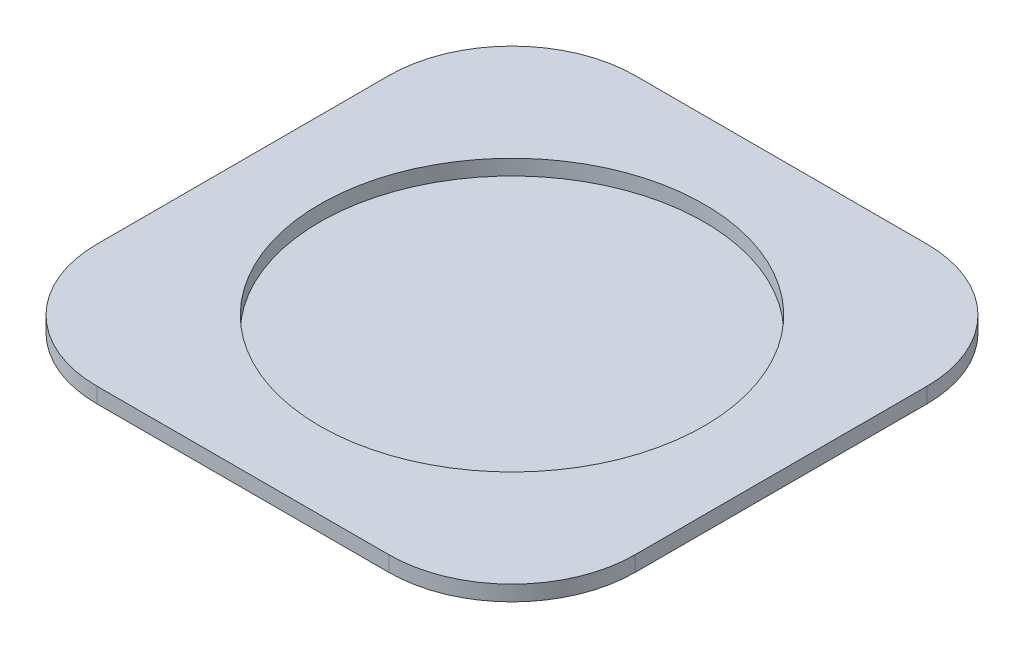
ISO-10303-21;
HEADER;
FILE_DESCRIPTION(('STEP AP214'),'2;1');
FILE_NAME('part.step','',(''),(''),'','','');
FILE_SCHEMA(('AUTOMOTIVE_DESIGN { 1 0 10303 214 1 1 1 1 }'));
ENDSEC;
DATA;
#1=APPLICATION_CONTEXT('core data for automotive mechanical design processes');
#2=APPLICATION_PROTOCOL_DEFINITION('international standard','automotive_design',2000,#1);
#3=PRODUCT_CONTEXT('',#1,'mechanical');
#4=PRODUCT('Part','Part','',(#3));
#5=PRODUCT_RELATED_PRODUCT_CATEGORY('part','',(#4));
#6=PRODUCT_DEFINITION_FORMATION('','',#4);
#7=PRODUCT_DEFINITION_CONTEXT('part definition',#1,'design');
#8=PRODUCT_DEFINITION('design','',#6,#7);
#9=PRODUCT_DEFINITION_SHAPE('','',#8);
#10=(LENGTH_UNIT() NAMED_UNIT(*) SI_UNIT(.MILLI.,.METRE.));
#11=(NAMED_UNIT(*) PLANE_ANGLE_UNIT() SI_UNIT($,.RADIAN.));
#12=(NAMED_UNIT(*) SI_UNIT($,.STERADIAN.) SOLID_ANGLE_UNIT());
#13=UNCERTAINTY_MEASURE_WITH_UNIT(LENGTH_MEASURE(1.E-05),#10,'distance_accuracy_value','');
#14=(GEOMETRIC_REPRESENTATION_CONTEXT(3) GLOBAL_UNCERTAINTY_ASSIGNED_CONTEXT((#13)) GLOBAL_UNIT_ASSIGNED_CONTEXT((#10,
#11,#12)) REPRESENTATION_CONTEXT('',''));
#15=CARTESIAN_POINT('',(0.,0.,0.));
#16=DIRECTION('',(0.,0.,1.));
#17=DIRECTION('',(1.,0.,0.));
#18=AXIS2_PLACEMENT_3D('',#15,#16,#17);
#19=CARTESIAN_POINT('',(0.,2.,0.));
#20=DIRECTION('',(0.,1.,0.));
#21=DIRECTION('',(0.,0.,1.));
#22=AXIS2_PLACEMENT_3D('',#19,#20,#21);
#23=PLANE('',#22);
#24=DIRECTION('',(0.,0.,-1.));
#25=VECTOR('',#24,1.);
#26=CARTESIAN_POINT('',(35.,2.,-35.));
#27=LINE('',#26,#25);
#28=CARTESIAN_POINT('',(35.,2.,19.));
#29=VERTEX_POINT('',#28);
#30=CARTESIAN_POINT('',(35.,2.,-19.));
#31=VERTEX_POINT('',#30);
#32=EDGE_CURVE('E180',#29,#31,#27,.T.);
#33=ORIENTED_EDGE('',*,*,#32,.T.);
#34=CARTESIAN_POINT('',(19.,2.,-19.));
#35=DIRECTION('',(0.,1.,0.));
#36=DIRECTION('',(0.,0.,1.));
#37=AXIS2_PLACEMENT_3D('',#34,#35,#36);
#38=CIRCLE('',#37,16.);
#39=CARTESIAN_POINT('',(19.,2.,-35.));
#40=VERTEX_POINT('',#39);
#41=EDGE_CURVE('E203',#31,#40,#38,.T.);
#42=ORIENTED_EDGE('',*,*,#41,.T.);
#43=DIRECTION('',(-1.,0.,0.));
#44=VECTOR('',#43,1.);
#45=CARTESIAN_POINT('',(-35.,2.,-35.));
#46=LINE('',#45,#44);
#47=CARTESIAN_POINT('',(-19.,2.,-35.));
#48=VERTEX_POINT('',#47);
#49=EDGE_CURVE('E156',#40,#48,#46,.T.);
#50=ORIENTED_EDGE('',*,*,#49,.T.);
#51=CARTESIAN_POINT('',(-19.,2.,-19.));
#52=DIRECTION('',(0.,1.,0.));
#53=DIRECTION('',(0.,0.,1.));
#54=AXIS2_PLACEMENT_3D('',#51,#52,#53);
#55=CIRCLE('',#54,16.);
#56=CARTESIAN_POINT('',(-35.,2.,-19.));
#57=VERTEX_POINT('',#56);
#58=EDGE_CURVE('E195',#48,#57,#55,.T.);
#59=ORIENTED_EDGE('',*,*,#58,.T.);
#60=DIRECTION('',(0.,0.,1.));
#61=VECTOR('',#60,1.);
#62=CARTESIAN_POINT('',(-35.,2.,-35.));
#63=LINE('',#62,#61);
#64=CARTESIAN_POINT('',(-35.,2.,19.));
#65=VERTEX_POINT('',#64);
#66=EDGE_CURVE('E220',#57,#65,#63,.T.);
#67=ORIENTED_EDGE('',*,*,#66,.T.);
#68=CARTESIAN_POINT('',(-19.,2.,19.));
#69=DIRECTION('',(0.,1.,0.));
#70=DIRECTION('',(0.,0.,1.));
#71=AXIS2_PLACEMENT_3D('',#68,#69,#70);
#72=CIRCLE('',#71,16.);
#73=CARTESIAN_POINT('',(-19.,2.,35.));
#74=VERTEX_POINT('',#73);
#75=EDGE_CURVE('E78',#65,#74,#72,.T.);
#76=ORIENTED_EDGE('',*,*,#75,.T.);
#77=DIRECTION('',(1.,0.,0.));
#78=VECTOR('',#77,1.);
#79=CARTESIAN_POINT('',(-35.,2.,35.));
#80=LINE('',#79,#78);
#81=CARTESIAN_POINT('',(19.,2.,35.));
#82=VERTEX_POINT('',#81);
#83=EDGE_CURVE('E182',#74,#82,#80,.T.);
#84=ORIENTED_EDGE('',*,*,#83,.T.);
#85=CARTESIAN_POINT('',(19.,2.,19.));
#86=DIRECTION('',(0.,1.,0.));
#87=DIRECTION('',(0.,0.,1.));
#88=AXIS2_PLACEMENT_3D('',#85,#86,#87);
#89=CIRCLE('',#88,16.);
#90=EDGE_CURVE('E198',#82,#29,#89,.T.);
#91=ORIENTED_EDGE('',*,*,#90,.T.);
#92=EDGE_LOOP('',(#33,#42,#50,#59,#67,#76,#84,#91));
#93=FACE_BOUND('',#92,.T.);
#94=CARTESIAN_POINT('',(0.,2.,0.));
#95=DIRECTION('',(0.,1.,0.));
#96=DIRECTION('',(0.,0.,1.));
#97=AXIS2_PLACEMENT_3D('',#94,#95,#96);
#98=CIRCLE('',#97,25.);
#99=CARTESIAN_POINT('',(0.,2.,25.));
#100=VERTEX_POINT('',#99);
#101=EDGE_CURVE('E174',#100,#100,#98,.T.);
#102=ORIENTED_EDGE('',*,*,#101,.F.);
#103=EDGE_LOOP('',(#102));
#104=FACE_BOUND('',#103,.T.);
#105=ADVANCED_FACE('F51',(#93,#104),#23,.T.);
#106=CARTESIAN_POINT('',(0.,0.,0.));
#107=DIRECTION('',(0.,1.,0.));
#108=DIRECTION('',(0.,0.,1.));
#109=AXIS2_PLACEMENT_3D('',#106,#107,#108);
#110=PLANE('',#109);
#111=CARTESIAN_POINT('',(0.,0.,0.));
#112=DIRECTION('',(0.,1.,0.));
#113=DIRECTION('',(0.,0.,1.));
#114=AXIS2_PLACEMENT_3D('',#111,#112,#113);
#115=CIRCLE('',#114,32.5);
#116=CARTESIAN_POINT('',(0.,0.,32.5));
#117=VERTEX_POINT('',#116);
#118=EDGE_CURVE('E13',#117,#117,#115,.F.);
#119=ORIENTED_EDGE('',*,*,#118,.F.);
#120=EDGE_LOOP('',(#119));
#121=FACE_BOUND('',#120,.T.);
#122=DIRECTION('',(-1.,0.,0.));
#123=VECTOR('',#122,1.);
#124=CARTESIAN_POINT('',(-35.,0.,-35.));
#125=LINE('',#124,#123);
#126=CARTESIAN_POINT('',(19.,0.,-35.));
#127=VERTEX_POINT('',#126);
#128=CARTESIAN_POINT('',(-19.,0.,-35.));
#129=VERTEX_POINT('',#128);
#130=EDGE_CURVE('E153',#127,#129,#125,.T.);
#131=ORIENTED_EDGE('',*,*,#130,.F.);
#132=CARTESIAN_POINT('',(19.,0.,-19.));
#133=DIRECTION('',(0.,1.,0.));
#134=DIRECTION('',(0.,0.,1.));
#135=AXIS2_PLACEMENT_3D('',#132,#133,#134);
#136=CIRCLE('',#135,16.);
#137=CARTESIAN_POINT('',(35.,0.,-19.));
#138=VERTEX_POINT('',#137);
#139=EDGE_CURVE('E135',#127,#138,#136,.F.);
#140=ORIENTED_EDGE('',*,*,#139,.T.);
#141=DIRECTION('',(0.,0.,-1.));
#142=VECTOR('',#141,1.);
#143=CARTESIAN_POINT('',(35.,0.,-35.));
#144=LINE('',#143,#142);
#145=CARTESIAN_POINT('',(35.,0.,19.));
#146=VERTEX_POINT('',#145);
#147=EDGE_CURVE('E165',#146,#138,#144,.T.);
#148=ORIENTED_EDGE('',*,*,#147,.F.);
#149=CARTESIAN_POINT('',(19.,0.,19.));
#150=DIRECTION('',(0.,1.,0.));
#151=DIRECTION('',(0.,0.,1.));
#152=AXIS2_PLACEMENT_3D('',#149,#150,#151);
#153=CIRCLE('',#152,16.);
#154=CARTESIAN_POINT('',(19.,0.,35.));
#155=VERTEX_POINT('',#154);
#156=EDGE_CURVE('E186',#146,#155,#153,.F.);
#157=ORIENTED_EDGE('',*,*,#156,.T.);
#158=DIRECTION('',(1.,0.,0.));
#159=VECTOR('',#158,1.);
#160=CARTESIAN_POINT('',(-35.,0.,35.));
#161=LINE('',#160,#159);
#162=CARTESIAN_POINT('',(-19.,0.,35.));
#163=VERTEX_POINT('',#162);
#164=EDGE_CURVE('E171',#163,#155,#161,.T.);
#165=ORIENTED_EDGE('',*,*,#164,.F.);
#166=CARTESIAN_POINT('',(-19.,0.,19.));
#167=DIRECTION('',(0.,1.,0.));
#168=DIRECTION('',(0.,0.,1.));
#169=AXIS2_PLACEMENT_3D('',#166,#167,#168);
#170=CIRCLE('',#169,16.);
#171=CARTESIAN_POINT('',(-35.,0.,19.));
#172=VERTEX_POINT('',#171);
#173=EDGE_CURVE('E147',#163,#172,#170,.F.);
#174=ORIENTED_EDGE('',*,*,#173,.T.);
#175=DIRECTION('',(0.,0.,1.));
#176=VECTOR('',#175,1.);
#177=CARTESIAN_POINT('',(-35.,0.,-35.));
#178=LINE('',#177,#176);
#179=CARTESIAN_POINT('',(-35.,0.,-19.));
#180=VERTEX_POINT('',#179);
#181=EDGE_CURVE('E164',#180,#172,#178,.T.);
#182=ORIENTED_EDGE('',*,*,#181,.F.);
#183=CARTESIAN_POINT('',(-19.,0.,-19.));
#184=DIRECTION('',(0.,1.,0.));
#185=DIRECTION('',(0.,0.,1.));
#186=AXIS2_PLACEMENT_3D('',#183,#184,#185);
#187=CIRCLE('',#186,16.);
#188=EDGE_CURVE('E158',#180,#129,#187,.F.);
#189=ORIENTED_EDGE('',*,*,#188,.T.);
#190=EDGE_LOOP('',(#131,#140,#148,#157,#165,#174,#182,#189));
#191=FACE_BOUND('',#190,.T.);
#192=ADVANCED_FACE('F161',(#121,#191),#110,.F.);
#193=CARTESIAN_POINT('',(35.,2.,-35.));
#194=DIRECTION('',(-1.,0.,0.));
#195=DIRECTION('',(0.,0.,1.));
#196=AXIS2_PLACEMENT_3D('',#193,#194,#195);
#197=PLANE('',#196);
#198=ORIENTED_EDGE('',*,*,#147,.T.);
#199=DIRECTION('',(0.,-1.,0.));
#200=VECTOR('',#199,1.);
#201=CARTESIAN_POINT('',(35.,2.,-19.));
#202=LINE('',#201,#200);
#203=EDGE_CURVE('E140',#138,#31,#202,.F.);
#204=ORIENTED_EDGE('',*,*,#203,.T.);
#205=ORIENTED_EDGE('',*,*,#32,.F.);
#206=DIRECTION('',(0.,-1.,0.));
#207=VECTOR('',#206,1.);
#208=CARTESIAN_POINT('',(35.,2.,19.));
#209=LINE('',#208,#207);
#210=EDGE_CURVE('E146',#29,#146,#209,.T.);
#211=ORIENTED_EDGE('',*,*,#210,.T.);
#212=EDGE_LOOP('',(#198,#204,#205,#211));
#213=FACE_BOUND('',#212,.T.);
#214=ADVANCED_FACE('F238',(#213),#197,.F.);
#215=CARTESIAN_POINT('',(-35.,2.,-35.));
#216=DIRECTION('',(0.,0.,1.));
#217=DIRECTION('',(1.,0.,0.));
#218=AXIS2_PLACEMENT_3D('',#215,#216,#217);
#219=PLANE('',#218);
#220=ORIENTED_EDGE('',*,*,#49,.F.);
#221=DIRECTION('',(0.,-1.,0.));
#222=VECTOR('',#221,1.);
#223=CARTESIAN_POINT('',(19.,2.,-35.));
#224=LINE('',#223,#222);
#225=EDGE_CURVE('E139',#40,#127,#224,.T.);
#226=ORIENTED_EDGE('',*,*,#225,.T.);
#227=ORIENTED_EDGE('',*,*,#130,.T.);
#228=DIRECTION('',(0.,-1.,0.));
#229=VECTOR('',#228,1.);
#230=CARTESIAN_POINT('',(-19.,2.,-35.));
#231=LINE('',#230,#229);
#232=EDGE_CURVE('E159',#129,#48,#231,.F.);
#233=ORIENTED_EDGE('',*,*,#232,.T.);
#234=EDGE_LOOP('',(#220,#226,#227,#233));
#235=FACE_BOUND('',#234,.T.);
#236=ADVANCED_FACE('F152',(#235),#219,.F.);
#237=CARTESIAN_POINT('',(-35.,2.,-35.));
#238=DIRECTION('',(1.,0.,0.));
#239=DIRECTION('',(0.,0.,-1.));
#240=AXIS2_PLACEMENT_3D('',#237,#238,#239);
#241=PLANE('',#240);
#242=ORIENTED_EDGE('',*,*,#181,.T.);
#243=DIRECTION('',(0.,-1.,0.));
#244=VECTOR('',#243,1.);
#245=CARTESIAN_POINT('',(-35.,2.,19.));
#246=LINE('',#245,#244);
#247=EDGE_CURVE('E60',#172,#65,#246,.F.);
#248=ORIENTED_EDGE('',*,*,#247,.T.);
#249=ORIENTED_EDGE('',*,*,#66,.F.);
#250=DIRECTION('',(0.,-1.,0.));
#251=VECTOR('',#250,1.);
#252=CARTESIAN_POINT('',(-35.,2.,-19.));
#253=LINE('',#252,#251);
#254=EDGE_CURVE('E212',#57,#180,#253,.T.);
#255=ORIENTED_EDGE('',*,*,#254,.T.);
#256=EDGE_LOOP('',(#242,#248,#249,#255));
#257=FACE_BOUND('',#256,.T.);
#258=ADVANCED_FACE('F219',(#257),#241,.F.);
#259=CARTESIAN_POINT('',(-35.,2.,35.));
#260=DIRECTION('',(0.,0.,-1.));
#261=DIRECTION('',(-1.,0.,0.));
#262=AXIS2_PLACEMENT_3D('',#259,#260,#261);
#263=PLANE('',#262);
#264=ORIENTED_EDGE('',*,*,#83,.F.);
#265=DIRECTION('',(0.,-1.,0.));
#266=VECTOR('',#265,1.);
#267=CARTESIAN_POINT('',(-19.,2.,35.));
#268=LINE('',#267,#266);
#269=EDGE_CURVE('E208',#74,#163,#268,.T.);
#270=ORIENTED_EDGE('',*,*,#269,.T.);
#271=ORIENTED_EDGE('',*,*,#164,.T.);
#272=DIRECTION('',(0.,-1.,0.));
#273=VECTOR('',#272,1.);
#274=CARTESIAN_POINT('',(19.,2.,35.));
#275=LINE('',#274,#273);
#276=EDGE_CURVE('E70',#155,#82,#275,.F.);
#277=ORIENTED_EDGE('',*,*,#276,.T.);
#278=EDGE_LOOP('',(#264,#270,#271,#277));
#279=FACE_BOUND('',#278,.T.);
#280=ADVANCED_FACE('F231',(#279),#263,.F.);
#281=CARTESIAN_POINT('',(0.,2.,0.));
#282=DIRECTION('',(0.,-1.,0.));
#283=DIRECTION('',(0.,0.,-1.));
#284=AXIS2_PLACEMENT_3D('',#281,#282,#283);
#285=CYLINDRICAL_SURFACE('',#284,25.);
#286=ORIENTED_EDGE('',*,*,#101,.T.);
#287=EDGE_LOOP('',(#286));
#288=FACE_BOUND('',#287,.T.);
#289=CARTESIAN_POINT('',(0.,0.,0.));
#290=DIRECTION('',(0.,1.,0.));
#291=DIRECTION('',(0.,0.,1.));
#292=AXIS2_PLACEMENT_3D('',#289,#290,#291);
#293=CIRCLE('',#292,25.);
#294=CARTESIAN_POINT('',(0.,0.,25.));
#295=VERTEX_POINT('',#294);
#296=EDGE_CURVE('E243',#295,#295,#293,.T.);
#297=ORIENTED_EDGE('',*,*,#296,.F.);
#298=EDGE_LOOP('',(#297));
#299=FACE_BOUND('',#298,.T.);
#300=ADVANCED_FACE('F256',(#288,#299),#285,.F.);
#301=CARTESIAN_POINT('',(19.,2.,-19.));
#302=DIRECTION('',(0.,-1.,0.));
#303=DIRECTION('',(0.,0.,-1.));
#304=AXIS2_PLACEMENT_3D('',#301,#302,#303);
#305=CYLINDRICAL_SURFACE('',#304,16.);
#306=ORIENTED_EDGE('',*,*,#41,.F.);
#307=ORIENTED_EDGE('',*,*,#203,.F.);
#308=ORIENTED_EDGE('',*,*,#139,.F.);
#309=ORIENTED_EDGE('',*,*,#225,.F.);
#310=EDGE_LOOP('',(#306,#307,#308,#309));
#311=FACE_BOUND('',#310,.T.);
#312=ADVANCED_FACE('F138',(#311),#305,.T.);
#313=CARTESIAN_POINT('',(-19.,2.,19.));
#314=DIRECTION('',(0.,-1.,0.));
#315=DIRECTION('',(0.,0.,-1.));
#316=AXIS2_PLACEMENT_3D('',#313,#314,#315);
#317=CYLINDRICAL_SURFACE('',#316,16.);
#318=ORIENTED_EDGE('',*,*,#75,.F.);
#319=ORIENTED_EDGE('',*,*,#247,.F.);
#320=ORIENTED_EDGE('',*,*,#173,.F.);
#321=ORIENTED_EDGE('',*,*,#269,.F.);
#322=EDGE_LOOP('',(#318,#319,#320,#321));
#323=FACE_BOUND('',#322,.T.);
#324=ADVANCED_FACE('F229',(#323),#317,.T.);
#325=CARTESIAN_POINT('',(19.,2.,19.));
#326=DIRECTION('',(0.,-1.,0.));
#327=DIRECTION('',(0.,0.,-1.));
#328=AXIS2_PLACEMENT_3D('',#325,#326,#327);
#329=CYLINDRICAL_SURFACE('',#328,16.);
#330=ORIENTED_EDGE('',*,*,#90,.F.);
#331=ORIENTED_EDGE('',*,*,#276,.F.);
#332=ORIENTED_EDGE('',*,*,#156,.F.);
#333=ORIENTED_EDGE('',*,*,#210,.F.);
#334=EDGE_LOOP('',(#330,#331,#332,#333));
#335=FACE_BOUND('',#334,.T.);
#336=ADVANCED_FACE('F235',(#335),#329,.T.);
#337=CARTESIAN_POINT('',(-19.,2.,-19.));
#338=DIRECTION('',(0.,-1.,0.));
#339=DIRECTION('',(0.,0.,-1.));
#340=AXIS2_PLACEMENT_3D('',#337,#338,#339);
#341=CYLINDRICAL_SURFACE('',#340,16.);
#342=ORIENTED_EDGE('',*,*,#58,.F.);
#343=ORIENTED_EDGE('',*,*,#232,.F.);
#344=ORIENTED_EDGE('',*,*,#188,.F.);
#345=ORIENTED_EDGE('',*,*,#254,.F.);
#346=EDGE_LOOP('',(#342,#343,#344,#345));
#347=FACE_BOUND('',#346,.T.);
#348=ADVANCED_FACE('F53',(#347),#341,.T.);
#349=CARTESIAN_POINT('',(0.,0.,0.));
#350=DIRECTION('',(0.,-1.,0.));
#351=DIRECTION('',(0.,0.,-1.));
#352=AXIS2_PLACEMENT_3D('',#349,#350,#351);
#353=PLANE('',#352);
#354=ORIENTED_EDGE('',*,*,#296,.T.);
#355=EDGE_LOOP('',(#354));
#356=FACE_BOUND('',#355,.T.);
#357=ADVANCED_FACE('F283',(#356),#353,.F.);
#358=CARTESIAN_POINT('',(0.,-2.,0.));
#359=DIRECTION('',(0.,1.,0.));
#360=DIRECTION('',(0.,0.,1.));
#361=AXIS2_PLACEMENT_3D('',#358,#359,#360);
#362=CYLINDRICAL_SURFACE('',#361,32.5);
#363=CARTESIAN_POINT('',(0.,-2.,0.));
#364=DIRECTION('',(0.,-1.,0.));
#365=DIRECTION('',(0.,0.,-1.));
#366=AXIS2_PLACEMENT_3D('',#363,#364,#365);
#367=CIRCLE('',#366,32.5);
#368=CARTESIAN_POINT('',(0.,-2.,-32.5));
#369=VERTEX_POINT('',#368);
#370=EDGE_CURVE('E247',#369,#369,#367,.T.);
#371=ORIENTED_EDGE('',*,*,#370,.F.);
#372=EDGE_LOOP('',(#371));
#373=FACE_BOUND('',#372,.T.);
#374=ORIENTED_EDGE('',*,*,#118,.T.);
#375=EDGE_LOOP('',(#374));
#376=FACE_BOUND('',#375,.T.);
#377=ADVANCED_FACE('F288',(#373,#376),#362,.T.);
#378=CARTESIAN_POINT('',(0.,-2.,0.));
#379=DIRECTION('',(0.,-1.,0.));
#380=DIRECTION('',(0.,0.,-1.));
#381=AXIS2_PLACEMENT_3D('',#378,#379,#380);
#382=PLANE('',#381);
#383=ORIENTED_EDGE('',*,*,#370,.T.);
#384=EDGE_LOOP('',(#383));
#385=FACE_BOUND('',#384,.T.);
#386=ADVANCED_FACE('F294',(#385),#382,.T.);
#387=CLOSED_SHELL('',(#105,#192,#214,#236,#258,#280,#300,#312,#324,#336,#348,#357,#377,#386));
#388=MANIFOLD_SOLID_BREP('B2',#387);
#389=ADVANCED_BREP_SHAPE_REPRESENTATION('',(#18,#388),#14);
#390=SHAPE_DEFINITION_REPRESENTATION(#9,#389);
ENDSEC;
END-ISO-10303-21;
